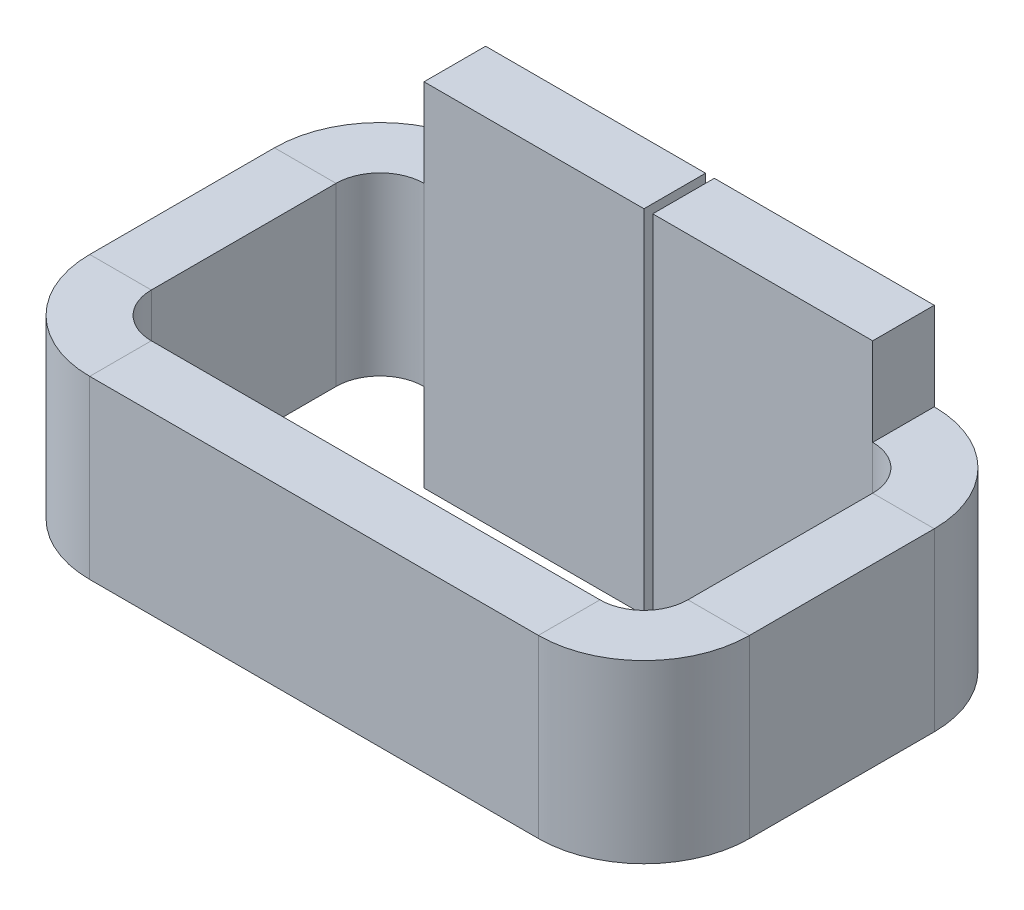
ISO-10303-21;
HEADER;
FILE_DESCRIPTION(('STEP AP214'),'2;1');
FILE_NAME('part.step','',(''),(''),'','','');
FILE_SCHEMA(('AUTOMOTIVE_DESIGN { 1 0 10303 214 1 1 1 1 }'));
ENDSEC;
DATA;
#1=APPLICATION_CONTEXT('core data for automotive mechanical design processes');
#2=APPLICATION_PROTOCOL_DEFINITION('international standard','automotive_design',2000,#1);
#3=PRODUCT_CONTEXT('',#1,'mechanical');
#4=PRODUCT('Part','Part','',(#3));
#5=PRODUCT_RELATED_PRODUCT_CATEGORY('part','',(#4));
#6=PRODUCT_DEFINITION_FORMATION('','',#4);
#7=PRODUCT_DEFINITION_CONTEXT('part definition',#1,'design');
#8=PRODUCT_DEFINITION('design','',#6,#7);
#9=PRODUCT_DEFINITION_SHAPE('','',#8);
#10=(LENGTH_UNIT() NAMED_UNIT(*) SI_UNIT(.MILLI.,.METRE.));
#11=(NAMED_UNIT(*) PLANE_ANGLE_UNIT() SI_UNIT($,.RADIAN.));
#12=(NAMED_UNIT(*) SI_UNIT($,.STERADIAN.) SOLID_ANGLE_UNIT());
#13=UNCERTAINTY_MEASURE_WITH_UNIT(LENGTH_MEASURE(1.E-05),#10,'distance_accuracy_value','');
#14=(GEOMETRIC_REPRESENTATION_CONTEXT(3) GLOBAL_UNCERTAINTY_ASSIGNED_CONTEXT((#13)) GLOBAL_UNIT_ASSIGNED_CONTEXT((#10,
#11,#12)) REPRESENTATION_CONTEXT('',''));
#15=CARTESIAN_POINT('',(0.,0.,0.));
#16=DIRECTION('',(0.,0.,1.));
#17=DIRECTION('',(1.,0.,0.));
#18=AXIS2_PLACEMENT_3D('',#15,#16,#17);
#19=CARTESIAN_POINT('',(3.71873970782007,-0.508000000000001,2.286));
#20=DIRECTION('',(0.,1.,0.));
#21=DIRECTION('',(1.,0.,0.));
#22=AXIS2_PLACEMENT_3D('',#19,#20,#21);
#23=PLANE('',#22);
#24=DIRECTION('',(0.,0.,1.));
#25=VECTOR('',#24,1.);
#26=CARTESIAN_POINT('',(-1.2954,-0.507999999999999,1.9304));
#27=LINE('',#26,#25);
#28=CARTESIAN_POINT('',(-1.2954,-0.507999999999999,1.9304));
#29=VERTEX_POINT('',#28);
#30=CARTESIAN_POINT('',(-1.2954,-0.507999999999999,2.286));
#31=VERTEX_POINT('',#30);
#32=EDGE_CURVE('E10',#29,#31,#27,.T.);
#33=ORIENTED_EDGE('',*,*,#32,.F.);
#34=DIRECTION('',(1.,0.,0.));
#35=VECTOR('',#34,1.);
#36=CARTESIAN_POINT('',(3.71873970782007,-0.508000000000001,1.9304));
#37=LINE('',#36,#35);
#38=CARTESIAN_POINT('',(1.2954,-0.508,1.9304));
#39=VERTEX_POINT('',#38);
#40=EDGE_CURVE('E23',#29,#39,#37,.T.);
#41=ORIENTED_EDGE('',*,*,#40,.T.);
#42=DIRECTION('',(0.,0.,-1.));
#43=VECTOR('',#42,1.);
#44=CARTESIAN_POINT('',(1.2954,-0.508,2.286));
#45=LINE('',#44,#43);
#46=CARTESIAN_POINT('',(1.2954,-0.508,2.286));
#47=VERTEX_POINT('',#46);
#48=EDGE_CURVE('E415',#47,#39,#45,.T.);
#49=ORIENTED_EDGE('',*,*,#48,.F.);
#50=DIRECTION('',(1.,0.,0.));
#51=VECTOR('',#50,1.);
#52=CARTESIAN_POINT('',(3.71873970782007,-0.508000000000001,2.286));
#53=LINE('',#52,#51);
#54=EDGE_CURVE('E412',#31,#47,#53,.T.);
#55=ORIENTED_EDGE('',*,*,#54,.F.);
#56=EDGE_LOOP('',(#33,#41,#49,#55));
#57=FACE_BOUND('',#56,.T.);
#58=ADVANCED_FACE('F16',(#57),#23,.F.);
#59=CARTESIAN_POINT('',(3.71873970782007,0.507999999999999,2.286));
#60=DIRECTION('',(0.,-1.,0.));
#61=DIRECTION('',(-1.,0.,0.));
#62=AXIS2_PLACEMENT_3D('',#59,#60,#61);
#63=PLANE('',#62);
#64=DIRECTION('',(0.,0.,-1.));
#65=VECTOR('',#64,1.);
#66=CARTESIAN_POINT('',(-1.2954,0.508000000000001,2.286));
#67=LINE('',#66,#65);
#68=CARTESIAN_POINT('',(-1.2954,0.508000000000001,2.286));
#69=VERTEX_POINT('',#68);
#70=CARTESIAN_POINT('',(-1.2954,0.508000000000001,1.9304));
#71=VERTEX_POINT('',#70);
#72=EDGE_CURVE('E409',#69,#71,#67,.T.);
#73=ORIENTED_EDGE('',*,*,#72,.F.);
#74=DIRECTION('',(-1.,0.,0.));
#75=VECTOR('',#74,1.);
#76=CARTESIAN_POINT('',(3.71873970782007,0.507999999999999,2.286));
#77=LINE('',#76,#75);
#78=CARTESIAN_POINT('',(1.2954,0.508,2.286));
#79=VERTEX_POINT('',#78);
#80=EDGE_CURVE('E406',#79,#69,#77,.T.);
#81=ORIENTED_EDGE('',*,*,#80,.F.);
#82=DIRECTION('',(0.,0.,1.));
#83=VECTOR('',#82,1.);
#84=CARTESIAN_POINT('',(1.2954,0.508,1.9304));
#85=LINE('',#84,#83);
#86=CARTESIAN_POINT('',(1.2954,0.508,1.9304));
#87=VERTEX_POINT('',#86);
#88=EDGE_CURVE('E403',#87,#79,#85,.T.);
#89=ORIENTED_EDGE('',*,*,#88,.F.);
#90=DIRECTION('',(-1.,0.,0.));
#91=VECTOR('',#90,1.);
#92=CARTESIAN_POINT('',(3.71873970782007,0.507999999999999,1.9304));
#93=LINE('',#92,#91);
#94=EDGE_CURVE('E400',#87,#71,#93,.T.);
#95=ORIENTED_EDGE('',*,*,#94,.T.);
#96=EDGE_LOOP('',(#73,#81,#89,#95));
#97=FACE_BOUND('',#96,.T.);
#98=ADVANCED_FACE('F444',(#97),#63,.F.);
#99=CARTESIAN_POINT('',(1.2954,-1.016,2.286));
#100=DIRECTION('',(0.,0.,1.));
#101=DIRECTION('',(-1.,0.,0.));
#102=AXIS2_PLACEMENT_3D('',#99,#100,#101);
#103=PLANE('',#102);
#104=ORIENTED_EDGE('',*,*,#80,.T.);
#105=DIRECTION('',(0.,1.,0.));
#106=VECTOR('',#105,1.);
#107=CARTESIAN_POINT('',(-1.2954,-1.016,2.286));
#108=LINE('',#107,#106);
#109=EDGE_CURVE('E397',#31,#69,#108,.T.);
#110=ORIENTED_EDGE('',*,*,#109,.F.);
#111=ORIENTED_EDGE('',*,*,#54,.T.);
#112=DIRECTION('',(0.,1.,0.));
#113=VECTOR('',#112,1.);
#114=CARTESIAN_POINT('',(1.2954,-1.016,2.286));
#115=LINE('',#114,#113);
#116=EDGE_CURVE('E394',#47,#79,#115,.T.);
#117=ORIENTED_EDGE('',*,*,#116,.T.);
#118=EDGE_LOOP('',(#104,#110,#111,#117));
#119=FACE_BOUND('',#118,.T.);
#120=ADVANCED_FACE('F437',(#119),#103,.T.);
#121=CARTESIAN_POINT('',(1.2954,-1.016,1.9304));
#122=DIRECTION('',(0.,0.,1.));
#123=DIRECTION('',(-1.,0.,0.));
#124=AXIS2_PLACEMENT_3D('',#121,#122,#123);
#125=PLANE('',#124);
#126=DIRECTION('',(0.,1.,0.));
#127=VECTOR('',#126,1.);
#128=CARTESIAN_POINT('',(-1.2954,-1.016,1.9304));
#129=LINE('',#128,#127);
#130=EDGE_CURVE('E391',#29,#71,#129,.T.);
#131=ORIENTED_EDGE('',*,*,#130,.T.);
#132=ORIENTED_EDGE('',*,*,#94,.F.);
#133=DIRECTION('',(0.,1.,0.));
#134=VECTOR('',#133,1.);
#135=CARTESIAN_POINT('',(1.2954,-1.016,1.9304));
#136=LINE('',#135,#134);
#137=EDGE_CURVE('E388',#39,#87,#136,.T.);
#138=ORIENTED_EDGE('',*,*,#137,.F.);
#139=ORIENTED_EDGE('',*,*,#40,.F.);
#140=EDGE_LOOP('',(#131,#132,#138,#139));
#141=FACE_BOUND('',#140,.T.);
#142=ADVANCED_FACE('F421',(#141),#125,.F.);
#143=CARTESIAN_POINT('',(0.0254,-1.016,0.));
#144=DIRECTION('',(-1.,0.,0.));
#145=DIRECTION('',(0.,0.,-1.));
#146=AXIS2_PLACEMENT_3D('',#143,#144,#145);
#147=PLANE('',#146);
#148=DIRECTION('',(0.,0.,1.));
#149=VECTOR('',#148,1.);
#150=CARTESIAN_POINT('',(0.0254000000000005,1.016,0.));
#151=LINE('',#150,#149);
#152=CARTESIAN_POINT('',(0.0254000000000005,1.016,0.));
#153=VERTEX_POINT('',#152);
#154=CARTESIAN_POINT('',(0.0254000000000005,1.016,0.3556));
#155=VERTEX_POINT('',#154);
#156=EDGE_CURVE('E386',#153,#155,#151,.T.);
#157=ORIENTED_EDGE('',*,*,#156,.F.);
#158=DIRECTION('',(0.,1.,0.));
#159=VECTOR('',#158,1.);
#160=CARTESIAN_POINT('',(0.0254,-1.016,0.));
#161=LINE('',#160,#159);
#162=CARTESIAN_POINT('',(0.0254,-1.016,0.));
#163=VERTEX_POINT('',#162);
#164=EDGE_CURVE('E383',#163,#153,#161,.T.);
#165=ORIENTED_EDGE('',*,*,#164,.F.);
#166=DIRECTION('',(0.,0.,1.));
#167=VECTOR('',#166,1.);
#168=CARTESIAN_POINT('',(0.0254,-1.016,0.));
#169=LINE('',#168,#167);
#170=CARTESIAN_POINT('',(0.0254,-1.016,0.3556));
#171=VERTEX_POINT('',#170);
#172=EDGE_CURVE('E381',#163,#171,#169,.T.);
#173=ORIENTED_EDGE('',*,*,#172,.T.);
#174=DIRECTION('',(0.,1.,0.));
#175=VECTOR('',#174,1.);
#176=CARTESIAN_POINT('',(0.0254,-1.016,0.3556));
#177=LINE('',#176,#175);
#178=EDGE_CURVE('E378',#171,#155,#177,.T.);
#179=ORIENTED_EDGE('',*,*,#178,.T.);
#180=EDGE_LOOP('',(#157,#165,#173,#179));
#181=FACE_BOUND('',#180,.T.);
#182=ADVANCED_FACE('F507',(#181),#147,.T.);
#183=CARTESIAN_POINT('',(1.5494,-1.016,0.6096));
#184=DIRECTION('',(0.,-1.,0.));
#185=DIRECTION('',(1.,0.,0.));
#186=AXIS2_PLACEMENT_3D('',#183,#184,#185);
#187=PLANE('',#186);
#188=DIRECTION('',(-1.,0.,0.));
#189=VECTOR('',#188,1.);
#190=CARTESIAN_POINT('',(0.0254,-1.016,0.));
#191=LINE('',#190,#189);
#192=CARTESIAN_POINT('',(1.2954,-1.016,0.));
#193=VERTEX_POINT('',#192);
#194=EDGE_CURVE('E375',#193,#163,#191,.T.);
#195=ORIENTED_EDGE('',*,*,#194,.F.);
#196=DIRECTION('',(0.,0.,1.));
#197=VECTOR('',#196,1.);
#198=CARTESIAN_POINT('',(1.2954,-1.016,0.));
#199=LINE('',#198,#197);
#200=CARTESIAN_POINT('',(1.2954,-1.016,0.3556));
#201=VERTEX_POINT('',#200);
#202=EDGE_CURVE('E372',#193,#201,#199,.T.);
#203=ORIENTED_EDGE('',*,*,#202,.T.);
#204=DIRECTION('',(-1.,0.,0.));
#205=VECTOR('',#204,1.);
#206=CARTESIAN_POINT('',(0.0254,-1.016,0.3556));
#207=LINE('',#206,#205);
#208=EDGE_CURVE('E369',#201,#171,#207,.T.);
#209=ORIENTED_EDGE('',*,*,#208,.T.);
#210=ORIENTED_EDGE('',*,*,#172,.F.);
#211=EDGE_LOOP('',(#195,#203,#209,#210));
#212=FACE_BOUND('',#211,.T.);
#213=ADVANCED_FACE('F510',(#212),#187,.T.);
#214=CARTESIAN_POINT('',(1.2954,1.016,0.6096));
#215=DIRECTION('',(0.,1.,0.));
#216=DIRECTION('',(-1.,0.,0.));
#217=AXIS2_PLACEMENT_3D('',#214,#215,#216);
#218=PLANE('',#217);
#219=DIRECTION('',(-1.,0.,0.));
#220=VECTOR('',#219,1.);
#221=CARTESIAN_POINT('',(0.0254000000000005,1.016,0.3556));
#222=LINE('',#221,#220);
#223=CARTESIAN_POINT('',(1.2954,1.016,0.3556));
#224=VERTEX_POINT('',#223);
#225=EDGE_CURVE('E366',#224,#155,#222,.T.);
#226=ORIENTED_EDGE('',*,*,#225,.F.);
#227=DIRECTION('',(0.,0.,-1.));
#228=VECTOR('',#227,1.);
#229=CARTESIAN_POINT('',(1.2954,1.016,0.3556));
#230=LINE('',#229,#228);
#231=CARTESIAN_POINT('',(1.2954,1.016,0.));
#232=VERTEX_POINT('',#231);
#233=EDGE_CURVE('E363',#224,#232,#230,.T.);
#234=ORIENTED_EDGE('',*,*,#233,.T.);
#235=DIRECTION('',(-1.,0.,0.));
#236=VECTOR('',#235,1.);
#237=CARTESIAN_POINT('',(0.0254000000000005,1.016,0.));
#238=LINE('',#237,#236);
#239=EDGE_CURVE('E360',#232,#153,#238,.T.);
#240=ORIENTED_EDGE('',*,*,#239,.T.);
#241=ORIENTED_EDGE('',*,*,#156,.T.);
#242=EDGE_LOOP('',(#226,#234,#240,#241));
#243=FACE_BOUND('',#242,.T.);
#244=ADVANCED_FACE('F514',(#243),#218,.T.);
#245=CARTESIAN_POINT('',(1.2954,1.016,0.));
#246=DIRECTION('',(-1.,0.,0.));
#247=DIRECTION('',(0.,-1.,0.));
#248=AXIS2_PLACEMENT_3D('',#245,#246,#247);
#249=PLANE('',#248);
#250=DIRECTION('',(0.,-1.,0.));
#251=VECTOR('',#250,1.);
#252=CARTESIAN_POINT('',(1.2954,1.016,0.3556));
#253=LINE('',#252,#251);
#254=CARTESIAN_POINT('',(1.2954,0.508,0.3556));
#255=VERTEX_POINT('',#254);
#256=EDGE_CURVE('E358',#224,#255,#253,.T.);
#257=ORIENTED_EDGE('',*,*,#256,.T.);
#258=DIRECTION('',(0.,0.,1.));
#259=VECTOR('',#258,1.);
#260=CARTESIAN_POINT('',(1.2954,0.508,0.));
#261=LINE('',#260,#259);
#262=CARTESIAN_POINT('',(1.2954,0.508,0.));
#263=VERTEX_POINT('',#262);
#264=EDGE_CURVE('E355',#263,#255,#261,.T.);
#265=ORIENTED_EDGE('',*,*,#264,.F.);
#266=DIRECTION('',(0.,-1.,0.));
#267=VECTOR('',#266,1.);
#268=CARTESIAN_POINT('',(1.2954,1.016,0.));
#269=LINE('',#268,#267);
#270=EDGE_CURVE('E352',#232,#263,#269,.T.);
#271=ORIENTED_EDGE('',*,*,#270,.F.);
#272=ORIENTED_EDGE('',*,*,#233,.F.);
#273=EDGE_LOOP('',(#257,#265,#271,#272));
#274=FACE_BOUND('',#273,.T.);
#275=ADVANCED_FACE('F518',(#274),#249,.F.);
#276=CARTESIAN_POINT('',(0.0254,-1.016,0.3556));
#277=DIRECTION('',(0.,0.,-1.));
#278=DIRECTION('',(1.,0.,0.));
#279=AXIS2_PLACEMENT_3D('',#276,#277,#278);
#280=PLANE('',#279);
#281=ORIENTED_EDGE('',*,*,#225,.T.);
#282=ORIENTED_EDGE('',*,*,#178,.F.);
#283=ORIENTED_EDGE('',*,*,#208,.F.);
#284=DIRECTION('',(0.,1.,0.));
#285=VECTOR('',#284,1.);
#286=CARTESIAN_POINT('',(1.2954,-1.016,0.3556));
#287=LINE('',#286,#285);
#288=CARTESIAN_POINT('',(1.2954,-0.508,0.3556));
#289=VERTEX_POINT('',#288);
#290=EDGE_CURVE('E350',#201,#289,#287,.T.);
#291=ORIENTED_EDGE('',*,*,#290,.T.);
#292=DIRECTION('',(0.,1.,0.));
#293=VECTOR('',#292,1.);
#294=CARTESIAN_POINT('',(1.2954,-1.016,0.3556));
#295=LINE('',#294,#293);
#296=EDGE_CURVE('E347',#289,#255,#295,.T.);
#297=ORIENTED_EDGE('',*,*,#296,.T.);
#298=ORIENTED_EDGE('',*,*,#256,.F.);
#299=EDGE_LOOP('',(#281,#282,#283,#291,#297,#298));
#300=FACE_BOUND('',#299,.T.);
#301=ADVANCED_FACE('F522',(#300),#280,.F.);
#302=CARTESIAN_POINT('',(1.2954,-1.016,0.));
#303=DIRECTION('',(-1.,0.,0.));
#304=DIRECTION('',(0.,-1.,0.));
#305=AXIS2_PLACEMENT_3D('',#302,#303,#304);
#306=PLANE('',#305);
#307=ORIENTED_EDGE('',*,*,#290,.F.);
#308=ORIENTED_EDGE('',*,*,#202,.F.);
#309=DIRECTION('',(0.,1.,0.));
#310=VECTOR('',#309,1.);
#311=CARTESIAN_POINT('',(1.2954,-1.016,0.));
#312=LINE('',#311,#310);
#313=CARTESIAN_POINT('',(1.2954,-0.508,0.));
#314=VERTEX_POINT('',#313);
#315=EDGE_CURVE('E345',#193,#314,#312,.T.);
#316=ORIENTED_EDGE('',*,*,#315,.T.);
#317=DIRECTION('',(0.,0.,1.));
#318=VECTOR('',#317,1.);
#319=CARTESIAN_POINT('',(1.2954,-0.508,0.));
#320=LINE('',#319,#318);
#321=EDGE_CURVE('E342',#314,#289,#320,.T.);
#322=ORIENTED_EDGE('',*,*,#321,.T.);
#323=EDGE_LOOP('',(#307,#308,#316,#322));
#324=FACE_BOUND('',#323,.T.);
#325=ADVANCED_FACE('F526',(#324),#306,.F.);
#326=CARTESIAN_POINT('',(0.0254,-1.016,0.));
#327=DIRECTION('',(0.,0.,-1.));
#328=DIRECTION('',(1.,0.,0.));
#329=AXIS2_PLACEMENT_3D('',#326,#327,#328);
#330=PLANE('',#329);
#331=ORIENTED_EDGE('',*,*,#239,.F.);
#332=ORIENTED_EDGE('',*,*,#270,.T.);
#333=DIRECTION('',(0.,1.,0.));
#334=VECTOR('',#333,1.);
#335=CARTESIAN_POINT('',(1.2954,-1.016,0.));
#336=LINE('',#335,#334);
#337=EDGE_CURVE('E339',#314,#263,#336,.T.);
#338=ORIENTED_EDGE('',*,*,#337,.F.);
#339=ORIENTED_EDGE('',*,*,#315,.F.);
#340=ORIENTED_EDGE('',*,*,#194,.T.);
#341=ORIENTED_EDGE('',*,*,#164,.T.);
#342=EDGE_LOOP('',(#331,#332,#338,#339,#340,#341));
#343=FACE_BOUND('',#342,.T.);
#344=ADVANCED_FACE('F530',(#343),#330,.T.);
#345=CARTESIAN_POINT('',(1.2954,0.508,0.6096));
#346=DIRECTION('',(0.,1.,0.));
#347=DIRECTION('',(-1.,0.,0.));
#348=AXIS2_PLACEMENT_3D('',#345,#346,#347);
#349=PLANE('',#348);
#350=ORIENTED_EDGE('',*,*,#264,.T.);
#351=CARTESIAN_POINT('',(1.2954,0.508,0.6096));
#352=DIRECTION('',(0.,-1.,0.));
#353=DIRECTION('',(1.,0.,0.));
#354=AXIS2_PLACEMENT_3D('',#351,#352,#353);
#355=CIRCLE('',#354,0.254);
#356=CARTESIAN_POINT('',(1.5494,0.508,0.609599999999999));
#357=VERTEX_POINT('',#356);
#358=EDGE_CURVE('E336',#255,#357,#355,.T.);
#359=ORIENTED_EDGE('',*,*,#358,.T.);
#360=DIRECTION('',(1.,0.,0.));
#361=VECTOR('',#360,1.);
#362=CARTESIAN_POINT('',(1.5494,0.508,0.609599999999999));
#363=LINE('',#362,#361);
#364=CARTESIAN_POINT('',(1.905,0.508,0.6096));
#365=VERTEX_POINT('',#364);
#366=EDGE_CURVE('E334',#357,#365,#363,.T.);
#367=ORIENTED_EDGE('',*,*,#366,.T.);
#368=CARTESIAN_POINT('',(1.2954,0.508,0.6096));
#369=DIRECTION('',(0.,-1.,0.));
#370=DIRECTION('',(1.,0.,0.));
#371=AXIS2_PLACEMENT_3D('',#368,#369,#370);
#372=CIRCLE('',#371,0.6096);
#373=EDGE_CURVE('E331',#263,#365,#372,.T.);
#374=ORIENTED_EDGE('',*,*,#373,.F.);
#375=EDGE_LOOP('',(#350,#359,#367,#374));
#376=FACE_BOUND('',#375,.T.);
#377=ADVANCED_FACE('F534',(#376),#349,.T.);
#378=CARTESIAN_POINT('',(1.2954,1.27230395532009,0.6096));
#379=DIRECTION('',(0.,-1.,0.));
#380=DIRECTION('',(1.,0.,0.));
#381=AXIS2_PLACEMENT_3D('',#378,#379,#380);
#382=CYLINDRICAL_SURFACE('',#381,0.254);
#383=CARTESIAN_POINT('',(1.2954,-0.508,0.6096));
#384=DIRECTION('',(0.,1.,0.));
#385=DIRECTION('',(1.,0.,0.));
#386=AXIS2_PLACEMENT_3D('',#383,#384,#385);
#387=CIRCLE('',#386,0.254);
#388=CARTESIAN_POINT('',(1.5494,-0.508,0.609599999999999));
#389=VERTEX_POINT('',#388);
#390=EDGE_CURVE('E328',#389,#289,#387,.T.);
#391=ORIENTED_EDGE('',*,*,#390,.F.);
#392=DIRECTION('',(0.,1.,0.));
#393=VECTOR('',#392,1.);
#394=CARTESIAN_POINT('',(1.5494,-1.016,0.6096));
#395=LINE('',#394,#393);
#396=EDGE_CURVE('E325',#389,#357,#395,.T.);
#397=ORIENTED_EDGE('',*,*,#396,.T.);
#398=ORIENTED_EDGE('',*,*,#358,.F.);
#399=ORIENTED_EDGE('',*,*,#296,.F.);
#400=EDGE_LOOP('',(#391,#397,#398,#399));
#401=FACE_BOUND('',#400,.T.);
#402=ADVANCED_FACE('F538',(#401),#382,.F.);
#403=CARTESIAN_POINT('',(1.2954,-0.508,0.6096));
#404=DIRECTION('',(0.,-1.,0.));
#405=DIRECTION('',(1.,0.,0.));
#406=AXIS2_PLACEMENT_3D('',#403,#404,#405);
#407=PLANE('',#406);
#408=DIRECTION('',(-1.,0.,0.));
#409=VECTOR('',#408,1.);
#410=CARTESIAN_POINT('',(1.905,-0.508000000000001,0.6096));
#411=LINE('',#410,#409);
#412=CARTESIAN_POINT('',(1.905,-0.508,0.609599999999997));
#413=VERTEX_POINT('',#412);
#414=EDGE_CURVE('E322',#413,#389,#411,.T.);
#415=ORIENTED_EDGE('',*,*,#414,.T.);
#416=ORIENTED_EDGE('',*,*,#390,.T.);
#417=ORIENTED_EDGE('',*,*,#321,.F.);
#418=CARTESIAN_POINT('',(1.2954,-0.508,0.6096));
#419=DIRECTION('',(0.,1.,0.));
#420=DIRECTION('',(-1.,0.,0.));
#421=AXIS2_PLACEMENT_3D('',#418,#419,#420);
#422=CIRCLE('',#421,0.6096);
#423=EDGE_CURVE('E319',#413,#314,#422,.T.);
#424=ORIENTED_EDGE('',*,*,#423,.F.);
#425=EDGE_LOOP('',(#415,#416,#417,#424));
#426=FACE_BOUND('',#425,.T.);
#427=ADVANCED_FACE('F542',(#426),#407,.T.);
#428=CARTESIAN_POINT('',(1.2954,1.27230395532009,0.6096));
#429=DIRECTION('',(0.,-1.,0.));
#430=DIRECTION('',(1.,0.,0.));
#431=AXIS2_PLACEMENT_3D('',#428,#429,#430);
#432=CYLINDRICAL_SURFACE('',#431,0.6096);
#433=ORIENTED_EDGE('',*,*,#423,.T.);
#434=ORIENTED_EDGE('',*,*,#337,.T.);
#435=ORIENTED_EDGE('',*,*,#373,.T.);
#436=DIRECTION('',(0.,1.,0.));
#437=VECTOR('',#436,1.);
#438=CARTESIAN_POINT('',(1.905,-1.016,0.6096));
#439=LINE('',#438,#437);
#440=EDGE_CURVE('E316',#413,#365,#439,.T.);
#441=ORIENTED_EDGE('',*,*,#440,.F.);
#442=EDGE_LOOP('',(#433,#434,#435,#441));
#443=FACE_BOUND('',#442,.T.);
#444=ADVANCED_FACE('F546',(#443),#432,.T.);
#445=CARTESIAN_POINT('',(1.905,-1.016,0.6096));
#446=DIRECTION('',(1.,0.,0.));
#447=DIRECTION('',(0.,0.,1.));
#448=AXIS2_PLACEMENT_3D('',#445,#446,#447);
#449=PLANE('',#448);
#450=DIRECTION('',(0.,0.,1.));
#451=VECTOR('',#450,1.);
#452=CARTESIAN_POINT('',(1.905,0.508,-0.0686698539100349));
#453=LINE('',#452,#451);
#454=CARTESIAN_POINT('',(1.905,0.508,1.6764));
#455=VERTEX_POINT('',#454);
#456=EDGE_CURVE('E313',#365,#455,#453,.T.);
#457=ORIENTED_EDGE('',*,*,#456,.T.);
#458=DIRECTION('',(0.,1.,0.));
#459=VECTOR('',#458,1.);
#460=CARTESIAN_POINT('',(1.905,-1.016,1.6764));
#461=LINE('',#460,#459);
#462=CARTESIAN_POINT('',(1.905,-0.508,1.6764));
#463=VERTEX_POINT('',#462);
#464=EDGE_CURVE('E310',#463,#455,#461,.T.);
#465=ORIENTED_EDGE('',*,*,#464,.F.);
#466=DIRECTION('',(0.,0.,-1.));
#467=VECTOR('',#466,1.);
#468=CARTESIAN_POINT('',(1.905,-0.508000000000001,-0.0686698539100348));
#469=LINE('',#468,#467);
#470=EDGE_CURVE('E307',#463,#413,#469,.T.);
#471=ORIENTED_EDGE('',*,*,#470,.T.);
#472=ORIENTED_EDGE('',*,*,#440,.T.);
#473=EDGE_LOOP('',(#457,#465,#471,#472));
#474=FACE_BOUND('',#473,.T.);
#475=ADVANCED_FACE('F550',(#474),#449,.T.);
#476=CARTESIAN_POINT('',(1.905,-0.508000000000001,-0.0686698539100348));
#477=DIRECTION('',(0.,1.,0.));
#478=DIRECTION('',(0.,0.,-1.));
#479=AXIS2_PLACEMENT_3D('',#476,#477,#478);
#480=PLANE('',#479);
#481=DIRECTION('',(1.,0.,0.));
#482=VECTOR('',#481,1.);
#483=CARTESIAN_POINT('',(1.5494,-0.508,1.6764));
#484=LINE('',#483,#482);
#485=CARTESIAN_POINT('',(1.5494,-0.508,1.6764));
#486=VERTEX_POINT('',#485);
#487=EDGE_CURVE('E304',#486,#463,#484,.T.);
#488=ORIENTED_EDGE('',*,*,#487,.F.);
#489=DIRECTION('',(0.,0.,-1.));
#490=VECTOR('',#489,1.);
#491=CARTESIAN_POINT('',(1.5494,-0.508,-0.0686698539100348));
#492=LINE('',#491,#490);
#493=EDGE_CURVE('E301',#486,#389,#492,.T.);
#494=ORIENTED_EDGE('',*,*,#493,.T.);
#495=ORIENTED_EDGE('',*,*,#414,.F.);
#496=ORIENTED_EDGE('',*,*,#470,.F.);
#497=EDGE_LOOP('',(#488,#494,#495,#496));
#498=FACE_BOUND('',#497,.T.);
#499=ADVANCED_FACE('F554',(#498),#480,.F.);
#500=CARTESIAN_POINT('',(1.5494,-1.016,0.6096));
#501=DIRECTION('',(1.,0.,0.));
#502=DIRECTION('',(0.,0.,1.));
#503=AXIS2_PLACEMENT_3D('',#500,#501,#502);
#504=PLANE('',#503);
#505=DIRECTION('',(0.,1.,0.));
#506=VECTOR('',#505,1.);
#507=CARTESIAN_POINT('',(1.5494,-1.016,1.6764));
#508=LINE('',#507,#506);
#509=CARTESIAN_POINT('',(1.5494,0.508,1.6764));
#510=VERTEX_POINT('',#509);
#511=EDGE_CURVE('E298',#486,#510,#508,.T.);
#512=ORIENTED_EDGE('',*,*,#511,.T.);
#513=DIRECTION('',(0.,0.,1.));
#514=VECTOR('',#513,1.);
#515=CARTESIAN_POINT('',(1.5494,0.508,-0.0686698539100349));
#516=LINE('',#515,#514);
#517=EDGE_CURVE('E296',#357,#510,#516,.T.);
#518=ORIENTED_EDGE('',*,*,#517,.F.);
#519=ORIENTED_EDGE('',*,*,#396,.F.);
#520=ORIENTED_EDGE('',*,*,#493,.F.);
#521=EDGE_LOOP('',(#512,#518,#519,#520));
#522=FACE_BOUND('',#521,.T.);
#523=ADVANCED_FACE('F558',(#522),#504,.F.);
#524=CARTESIAN_POINT('',(1.905,0.508,-0.0686698539100349));
#525=DIRECTION('',(0.,-1.,0.));
#526=DIRECTION('',(0.,0.,1.));
#527=AXIS2_PLACEMENT_3D('',#524,#525,#526);
#528=PLANE('',#527);
#529=DIRECTION('',(-1.,0.,0.));
#530=VECTOR('',#529,1.);
#531=CARTESIAN_POINT('',(1.905,0.508,1.6764));
#532=LINE('',#531,#530);
#533=EDGE_CURVE('E293',#455,#510,#532,.T.);
#534=ORIENTED_EDGE('',*,*,#533,.F.);
#535=ORIENTED_EDGE('',*,*,#456,.F.);
#536=ORIENTED_EDGE('',*,*,#366,.F.);
#537=ORIENTED_EDGE('',*,*,#517,.T.);
#538=EDGE_LOOP('',(#534,#535,#536,#537));
#539=FACE_BOUND('',#538,.T.);
#540=ADVANCED_FACE('F562',(#539),#528,.F.);
#541=CARTESIAN_POINT('',(1.2954,0.508,1.6764));
#542=DIRECTION('',(0.,1.,0.));
#543=DIRECTION('',(-1.,0.,0.));
#544=AXIS2_PLACEMENT_3D('',#541,#542,#543);
#545=PLANE('',#544);
#546=ORIENTED_EDGE('',*,*,#533,.T.);
#547=CARTESIAN_POINT('',(1.2954,0.508,1.6764));
#548=DIRECTION('',(0.,-1.,0.));
#549=DIRECTION('',(1.,0.,0.));
#550=AXIS2_PLACEMENT_3D('',#547,#548,#549);
#551=CIRCLE('',#550,0.254);
#552=EDGE_CURVE('E291',#510,#87,#551,.T.);
#553=ORIENTED_EDGE('',*,*,#552,.T.);
#554=ORIENTED_EDGE('',*,*,#88,.T.);
#555=CARTESIAN_POINT('',(1.2954,0.508,1.6764));
#556=DIRECTION('',(0.,-1.,0.));
#557=DIRECTION('',(1.,0.,0.));
#558=AXIS2_PLACEMENT_3D('',#555,#556,#557);
#559=CIRCLE('',#558,0.6096);
#560=EDGE_CURVE('E289',#455,#79,#559,.T.);
#561=ORIENTED_EDGE('',*,*,#560,.F.);
#562=EDGE_LOOP('',(#546,#553,#554,#561));
#563=FACE_BOUND('',#562,.T.);
#564=ADVANCED_FACE('F566',(#563),#545,.T.);
#565=CARTESIAN_POINT('',(1.2954,-0.508,1.6764));
#566=DIRECTION('',(0.,-1.,0.));
#567=DIRECTION('',(1.,0.,0.));
#568=AXIS2_PLACEMENT_3D('',#565,#566,#567);
#569=PLANE('',#568);
#570=ORIENTED_EDGE('',*,*,#48,.T.);
#571=CARTESIAN_POINT('',(1.2954,-0.508,1.6764));
#572=DIRECTION('',(0.,1.,0.));
#573=DIRECTION('',(1.,0.,0.));
#574=AXIS2_PLACEMENT_3D('',#571,#572,#573);
#575=CIRCLE('',#574,0.254);
#576=EDGE_CURVE('E287',#39,#486,#575,.T.);
#577=ORIENTED_EDGE('',*,*,#576,.T.);
#578=ORIENTED_EDGE('',*,*,#487,.T.);
#579=CARTESIAN_POINT('',(1.2954,-0.508,1.6764));
#580=DIRECTION('',(0.,1.,0.));
#581=DIRECTION('',(-1.,0.,0.));
#582=AXIS2_PLACEMENT_3D('',#579,#580,#581);
#583=CIRCLE('',#582,0.6096);
#584=EDGE_CURVE('E285',#47,#463,#583,.T.);
#585=ORIENTED_EDGE('',*,*,#584,.F.);
#586=EDGE_LOOP('',(#570,#577,#578,#585));
#587=FACE_BOUND('',#586,.T.);
#588=ADVANCED_FACE('F428',(#587),#569,.T.);
#589=CARTESIAN_POINT('',(1.2954,1.27230395532009,1.6764));
#590=DIRECTION('',(0.,-1.,0.));
#591=DIRECTION('',(1.,0.,0.));
#592=AXIS2_PLACEMENT_3D('',#589,#590,#591);
#593=CYLINDRICAL_SURFACE('',#592,0.6096);
#594=ORIENTED_EDGE('',*,*,#584,.T.);
#595=ORIENTED_EDGE('',*,*,#464,.T.);
#596=ORIENTED_EDGE('',*,*,#560,.T.);
#597=ORIENTED_EDGE('',*,*,#116,.F.);
#598=EDGE_LOOP('',(#594,#595,#596,#597));
#599=FACE_BOUND('',#598,.T.);
#600=ADVANCED_FACE('F433',(#599),#593,.T.);
#601=CARTESIAN_POINT('',(1.2954,1.27230395532009,1.6764));
#602=DIRECTION('',(0.,-1.,0.));
#603=DIRECTION('',(1.,0.,0.));
#604=AXIS2_PLACEMENT_3D('',#601,#602,#603);
#605=CYLINDRICAL_SURFACE('',#604,0.254);
#606=ORIENTED_EDGE('',*,*,#576,.F.);
#607=ORIENTED_EDGE('',*,*,#137,.T.);
#608=ORIENTED_EDGE('',*,*,#552,.F.);
#609=ORIENTED_EDGE('',*,*,#511,.F.);
#610=EDGE_LOOP('',(#606,#607,#608,#609));
#611=FACE_BOUND('',#610,.T.);
#612=ADVANCED_FACE('F575',(#611),#605,.F.);
#613=CARTESIAN_POINT('',(-1.2954,0.508000000000002,1.6764));
#614=DIRECTION('',(0.,1.,0.));
#615=DIRECTION('',(-1.,0.,0.));
#616=AXIS2_PLACEMENT_3D('',#613,#614,#615);
#617=PLANE('',#616);
#618=ORIENTED_EDGE('',*,*,#72,.T.);
#619=CARTESIAN_POINT('',(-1.2954,0.508000000000002,1.6764));
#620=DIRECTION('',(0.,-1.,0.));
#621=DIRECTION('',(1.,0.,0.));
#622=AXIS2_PLACEMENT_3D('',#619,#620,#621);
#623=CIRCLE('',#622,0.254);
#624=CARTESIAN_POINT('',(-1.5494,0.508000000000001,1.6764));
#625=VERTEX_POINT('',#624);
#626=EDGE_CURVE('E283',#71,#625,#623,.T.);
#627=ORIENTED_EDGE('',*,*,#626,.T.);
#628=DIRECTION('',(-1.,0.,0.));
#629=VECTOR('',#628,1.);
#630=CARTESIAN_POINT('',(-1.5494,0.508000000000001,1.6764));
#631=LINE('',#630,#629);
#632=CARTESIAN_POINT('',(-1.905,0.508000000000001,1.6764));
#633=VERTEX_POINT('',#632);
#634=EDGE_CURVE('E281',#625,#633,#631,.T.);
#635=ORIENTED_EDGE('',*,*,#634,.T.);
#636=CARTESIAN_POINT('',(-1.2954,0.508000000000002,1.6764));
#637=DIRECTION('',(0.,-1.,0.));
#638=DIRECTION('',(1.,0.,0.));
#639=AXIS2_PLACEMENT_3D('',#636,#637,#638);
#640=CIRCLE('',#639,0.6096);
#641=EDGE_CURVE('E278',#69,#633,#640,.T.);
#642=ORIENTED_EDGE('',*,*,#641,.F.);
#643=EDGE_LOOP('',(#618,#627,#635,#642));
#644=FACE_BOUND('',#643,.T.);
#645=ADVANCED_FACE('F446',(#644),#617,.T.);
#646=CARTESIAN_POINT('',(-1.2954,-0.507999999999999,1.6764));
#647=DIRECTION('',(0.,-1.,0.));
#648=DIRECTION('',(1.,0.,0.));
#649=AXIS2_PLACEMENT_3D('',#646,#647,#648);
#650=PLANE('',#649);
#651=DIRECTION('',(1.,0.,0.));
#652=VECTOR('',#651,1.);
#653=CARTESIAN_POINT('',(-1.905,-0.507999999999999,1.6764));
#654=LINE('',#653,#652);
#655=CARTESIAN_POINT('',(-1.905,-0.507999999999999,1.6764));
#656=VERTEX_POINT('',#655);
#657=CARTESIAN_POINT('',(-1.5494,-0.507999999999999,1.6764));
#658=VERTEX_POINT('',#657);
#659=EDGE_CURVE('E276',#656,#658,#654,.T.);
#660=ORIENTED_EDGE('',*,*,#659,.T.);
#661=CARTESIAN_POINT('',(-1.2954,-0.507999999999998,1.6764));
#662=DIRECTION('',(0.,1.,0.));
#663=DIRECTION('',(1.,0.,0.));
#664=AXIS2_PLACEMENT_3D('',#661,#662,#663);
#665=CIRCLE('',#664,0.254);
#666=EDGE_CURVE('E274',#658,#29,#665,.T.);
#667=ORIENTED_EDGE('',*,*,#666,.T.);
#668=ORIENTED_EDGE('',*,*,#32,.T.);
#669=CARTESIAN_POINT('',(-1.2954,-0.507999999999999,1.6764));
#670=DIRECTION('',(0.,1.,0.));
#671=DIRECTION('',(-1.,0.,0.));
#672=AXIS2_PLACEMENT_3D('',#669,#670,#671);
#673=CIRCLE('',#672,0.6096);
#674=EDGE_CURVE('E272',#656,#31,#673,.T.);
#675=ORIENTED_EDGE('',*,*,#674,.F.);
#676=EDGE_LOOP('',(#660,#667,#668,#675));
#677=FACE_BOUND('',#676,.T.);
#678=ADVANCED_FACE('F580',(#677),#650,.T.);
#679=CARTESIAN_POINT('',(-1.2954,1.27230395532009,1.6764));
#680=DIRECTION('',(0.,-1.,0.));
#681=DIRECTION('',(1.,0.,0.));
#682=AXIS2_PLACEMENT_3D('',#679,#680,#681);
#683=CYLINDRICAL_SURFACE('',#682,0.6096);
#684=ORIENTED_EDGE('',*,*,#674,.T.);
#685=ORIENTED_EDGE('',*,*,#109,.T.);
#686=ORIENTED_EDGE('',*,*,#641,.T.);
#687=DIRECTION('',(0.,1.,0.));
#688=VECTOR('',#687,1.);
#689=CARTESIAN_POINT('',(-1.905,-1.016,1.6764));
#690=LINE('',#689,#688);
#691=EDGE_CURVE('E269',#656,#633,#690,.T.);
#692=ORIENTED_EDGE('',*,*,#691,.F.);
#693=EDGE_LOOP('',(#684,#685,#686,#692));
#694=FACE_BOUND('',#693,.T.);
#695=ADVANCED_FACE('F441',(#694),#683,.T.);
#696=CARTESIAN_POINT('',(-1.2954,1.27230395532009,1.6764));
#697=DIRECTION('',(0.,-1.,0.));
#698=DIRECTION('',(1.,0.,0.));
#699=AXIS2_PLACEMENT_3D('',#696,#697,#698);
#700=CYLINDRICAL_SURFACE('',#699,0.254);
#701=ORIENTED_EDGE('',*,*,#666,.F.);
#702=DIRECTION('',(0.,1.,0.));
#703=VECTOR('',#702,1.);
#704=CARTESIAN_POINT('',(-1.5494,-1.016,1.6764));
#705=LINE('',#704,#703);
#706=EDGE_CURVE('E266',#658,#625,#705,.T.);
#707=ORIENTED_EDGE('',*,*,#706,.T.);
#708=ORIENTED_EDGE('',*,*,#626,.F.);
#709=ORIENTED_EDGE('',*,*,#130,.F.);
#710=EDGE_LOOP('',(#701,#707,#708,#709));
#711=FACE_BOUND('',#710,.T.);
#712=ADVANCED_FACE('F456',(#711),#700,.F.);
#713=CARTESIAN_POINT('',(-1.905,-1.016,0.609600000000001));
#714=DIRECTION('',(-1.,0.,0.));
#715=DIRECTION('',(0.,-1.,0.));
#716=AXIS2_PLACEMENT_3D('',#713,#714,#715);
#717=PLANE('',#716);
#718=DIRECTION('',(0.,0.,-1.));
#719=VECTOR('',#718,1.);
#720=CARTESIAN_POINT('',(-1.905,0.508000000000001,7.36880956173011));
#721=LINE('',#720,#719);
#722=CARTESIAN_POINT('',(-1.905,0.508000000000002,0.609600000000001));
#723=VERTEX_POINT('',#722);
#724=EDGE_CURVE('E264',#633,#723,#721,.T.);
#725=ORIENTED_EDGE('',*,*,#724,.T.);
#726=DIRECTION('',(0.,1.,0.));
#727=VECTOR('',#726,1.);
#728=CARTESIAN_POINT('',(-1.905,-1.016,0.609600000000001));
#729=LINE('',#728,#727);
#730=CARTESIAN_POINT('',(-1.905,-0.507999999999999,0.609600000000001));
#731=VERTEX_POINT('',#730);
#732=EDGE_CURVE('E261',#731,#723,#729,.T.);
#733=ORIENTED_EDGE('',*,*,#732,.F.);
#734=DIRECTION('',(0.,0.,1.));
#735=VECTOR('',#734,1.);
#736=CARTESIAN_POINT('',(-1.905,-0.507999999999999,7.36880956173011));
#737=LINE('',#736,#735);
#738=EDGE_CURVE('E258',#731,#656,#737,.T.);
#739=ORIENTED_EDGE('',*,*,#738,.T.);
#740=ORIENTED_EDGE('',*,*,#691,.T.);
#741=EDGE_LOOP('',(#725,#733,#739,#740));
#742=FACE_BOUND('',#741,.T.);
#743=ADVANCED_FACE('F587',(#742),#717,.T.);
#744=CARTESIAN_POINT('',(-1.905,0.508000000000001,7.36880956173011));
#745=DIRECTION('',(0.,-1.,0.));
#746=DIRECTION('',(0.,0.,-1.));
#747=AXIS2_PLACEMENT_3D('',#744,#745,#746);
#748=PLANE('',#747);
#749=DIRECTION('',(1.,0.,0.));
#750=VECTOR('',#749,1.);
#751=CARTESIAN_POINT('',(-1.905,0.508000000000002,0.609600000000001));
#752=LINE('',#751,#750);
#753=CARTESIAN_POINT('',(-1.5494,0.508000000000001,0.609600000000001));
#754=VERTEX_POINT('',#753);
#755=EDGE_CURVE('E256',#723,#754,#752,.T.);
#756=ORIENTED_EDGE('',*,*,#755,.F.);
#757=ORIENTED_EDGE('',*,*,#724,.F.);
#758=ORIENTED_EDGE('',*,*,#634,.F.);
#759=DIRECTION('',(0.,0.,-1.));
#760=VECTOR('',#759,1.);
#761=CARTESIAN_POINT('',(-1.5494,0.508000000000001,7.36880956173011));
#762=LINE('',#761,#760);
#763=EDGE_CURVE('E253',#625,#754,#762,.T.);
#764=ORIENTED_EDGE('',*,*,#763,.T.);
#765=EDGE_LOOP('',(#756,#757,#758,#764));
#766=FACE_BOUND('',#765,.T.);
#767=ADVANCED_FACE('F451',(#766),#748,.F.);
#768=CARTESIAN_POINT('',(-1.5494,-1.016,0.609600000000001));
#769=DIRECTION('',(-1.,0.,0.));
#770=DIRECTION('',(0.,-1.,0.));
#771=AXIS2_PLACEMENT_3D('',#768,#769,#770);
#772=PLANE('',#771);
#773=DIRECTION('',(0.,1.,0.));
#774=VECTOR('',#773,1.);
#775=CARTESIAN_POINT('',(-1.5494,-1.016,0.609600000000001));
#776=LINE('',#775,#774);
#777=CARTESIAN_POINT('',(-1.5494,-0.507999999999999,0.609600000000001));
#778=VERTEX_POINT('',#777);
#779=EDGE_CURVE('E250',#778,#754,#776,.T.);
#780=ORIENTED_EDGE('',*,*,#779,.T.);
#781=ORIENTED_EDGE('',*,*,#763,.F.);
#782=ORIENTED_EDGE('',*,*,#706,.F.);
#783=DIRECTION('',(0.,0.,1.));
#784=VECTOR('',#783,1.);
#785=CARTESIAN_POINT('',(-1.5494,-0.507999999999999,7.36880956173011));
#786=LINE('',#785,#784);
#787=EDGE_CURVE('E247',#778,#658,#786,.T.);
#788=ORIENTED_EDGE('',*,*,#787,.F.);
#789=EDGE_LOOP('',(#780,#781,#782,#788));
#790=FACE_BOUND('',#789,.T.);
#791=ADVANCED_FACE('F459',(#790),#772,.F.);
#792=CARTESIAN_POINT('',(-1.905,-0.507999999999999,7.36880956173011));
#793=DIRECTION('',(0.,1.,0.));
#794=DIRECTION('',(0.,0.,1.));
#795=AXIS2_PLACEMENT_3D('',#792,#793,#794);
#796=PLANE('',#795);
#797=DIRECTION('',(-1.,0.,0.));
#798=VECTOR('',#797,1.);
#799=CARTESIAN_POINT('',(-1.5494,-0.507999999999999,0.609600000000001));
#800=LINE('',#799,#798);
#801=EDGE_CURVE('E244',#778,#731,#800,.T.);
#802=ORIENTED_EDGE('',*,*,#801,.F.);
#803=ORIENTED_EDGE('',*,*,#787,.T.);
#804=ORIENTED_EDGE('',*,*,#659,.F.);
#805=ORIENTED_EDGE('',*,*,#738,.F.);
#806=EDGE_LOOP('',(#802,#803,#804,#805));
#807=FACE_BOUND('',#806,.T.);
#808=ADVANCED_FACE('F595',(#807),#796,.F.);
#809=CARTESIAN_POINT('',(-1.2954,0.508000000000001,0.609600000000001));
#810=DIRECTION('',(0.,1.,0.));
#811=DIRECTION('',(-1.,0.,0.));
#812=AXIS2_PLACEMENT_3D('',#809,#810,#811);
#813=PLANE('',#812);
#814=ORIENTED_EDGE('',*,*,#755,.T.);
#815=CARTESIAN_POINT('',(-1.2954,0.508000000000001,0.609600000000001));
#816=DIRECTION('',(0.,-1.,0.));
#817=DIRECTION('',(1.,0.,0.));
#818=AXIS2_PLACEMENT_3D('',#815,#816,#817);
#819=CIRCLE('',#818,0.254);
#820=CARTESIAN_POINT('',(-1.2954,0.508000000000001,0.355600000000005));
#821=VERTEX_POINT('',#820);
#822=EDGE_CURVE('E242',#754,#821,#819,.T.);
#823=ORIENTED_EDGE('',*,*,#822,.T.);
#824=DIRECTION('',(0.,0.,1.));
#825=VECTOR('',#824,1.);
#826=CARTESIAN_POINT('',(-1.2954,0.508000000000001,0.));
#827=LINE('',#826,#825);
#828=CARTESIAN_POINT('',(-1.2954,0.508000000000001,0.));
#829=VERTEX_POINT('',#828);
#830=EDGE_CURVE('E198',#829,#821,#827,.T.);
#831=ORIENTED_EDGE('',*,*,#830,.F.);
#832=CARTESIAN_POINT('',(-1.2954,0.508000000000001,0.609600000000001));
#833=DIRECTION('',(0.,-1.,0.));
#834=DIRECTION('',(1.,0.,0.));
#835=AXIS2_PLACEMENT_3D('',#832,#833,#834);
#836=CIRCLE('',#835,0.6096);
#837=EDGE_CURVE('E238',#723,#829,#836,.T.);
#838=ORIENTED_EDGE('',*,*,#837,.F.);
#839=EDGE_LOOP('',(#814,#823,#831,#838));
#840=FACE_BOUND('',#839,.T.);
#841=ADVANCED_FACE('F466',(#840),#813,.T.);
#842=CARTESIAN_POINT('',(-1.2954,-0.507999999999999,0.609600000000001));
#843=DIRECTION('',(0.,-1.,0.));
#844=DIRECTION('',(1.,0.,0.));
#845=AXIS2_PLACEMENT_3D('',#842,#843,#844);
#846=PLANE('',#845);
#847=DIRECTION('',(0.,0.,1.));
#848=VECTOR('',#847,1.);
#849=CARTESIAN_POINT('',(-1.2954,-0.507999999999999,0.));
#850=LINE('',#849,#848);
#851=CARTESIAN_POINT('',(-1.29540000000001,-0.507999999999999,0.));
#852=VERTEX_POINT('',#851);
#853=CARTESIAN_POINT('',(-1.2954,-0.507999999999999,0.355600000000004));
#854=VERTEX_POINT('',#853);
#855=EDGE_CURVE('E236',#852,#854,#850,.T.);
#856=ORIENTED_EDGE('',*,*,#855,.T.);
#857=CARTESIAN_POINT('',(-1.2954,-0.507999999999999,0.609600000000001));
#858=DIRECTION('',(0.,1.,0.));
#859=DIRECTION('',(1.,0.,0.));
#860=AXIS2_PLACEMENT_3D('',#857,#858,#859);
#861=CIRCLE('',#860,0.254);
#862=EDGE_CURVE('E233',#854,#778,#861,.T.);
#863=ORIENTED_EDGE('',*,*,#862,.T.);
#864=ORIENTED_EDGE('',*,*,#801,.T.);
#865=CARTESIAN_POINT('',(-1.2954,-0.507999999999999,0.609600000000001));
#866=DIRECTION('',(0.,1.,0.));
#867=DIRECTION('',(-1.,0.,0.));
#868=AXIS2_PLACEMENT_3D('',#865,#866,#867);
#869=CIRCLE('',#868,0.6096);
#870=EDGE_CURVE('E230',#852,#731,#869,.T.);
#871=ORIENTED_EDGE('',*,*,#870,.F.);
#872=EDGE_LOOP('',(#856,#863,#864,#871));
#873=FACE_BOUND('',#872,.T.);
#874=ADVANCED_FACE('F482',(#873),#846,.T.);
#875=CARTESIAN_POINT('',(-1.2954,1.27230395532009,0.609600000000001));
#876=DIRECTION('',(0.,-1.,0.));
#877=DIRECTION('',(1.,0.,0.));
#878=AXIS2_PLACEMENT_3D('',#875,#876,#877);
#879=CYLINDRICAL_SURFACE('',#878,0.6096);
#880=ORIENTED_EDGE('',*,*,#870,.T.);
#881=ORIENTED_EDGE('',*,*,#732,.T.);
#882=ORIENTED_EDGE('',*,*,#837,.T.);
#883=DIRECTION('',(0.,1.,0.));
#884=VECTOR('',#883,1.);
#885=CARTESIAN_POINT('',(-1.2954,-1.016,0.));
#886=LINE('',#885,#884);
#887=EDGE_CURVE('E227',#852,#829,#886,.T.);
#888=ORIENTED_EDGE('',*,*,#887,.F.);
#889=EDGE_LOOP('',(#880,#881,#882,#888));
#890=FACE_BOUND('',#889,.T.);
#891=ADVANCED_FACE('F470',(#890),#879,.T.);
#892=CARTESIAN_POINT('',(-1.2954,1.27230395532009,0.609600000000001));
#893=DIRECTION('',(0.,-1.,0.));
#894=DIRECTION('',(1.,0.,0.));
#895=AXIS2_PLACEMENT_3D('',#892,#893,#894);
#896=CYLINDRICAL_SURFACE('',#895,0.254);
#897=ORIENTED_EDGE('',*,*,#862,.F.);
#898=DIRECTION('',(0.,1.,0.));
#899=VECTOR('',#898,1.);
#900=CARTESIAN_POINT('',(-1.2954,-1.016,0.355600000000005));
#901=LINE('',#900,#899);
#902=EDGE_CURVE('E225',#854,#821,#901,.T.);
#903=ORIENTED_EDGE('',*,*,#902,.T.);
#904=ORIENTED_EDGE('',*,*,#822,.F.);
#905=ORIENTED_EDGE('',*,*,#779,.F.);
#906=EDGE_LOOP('',(#897,#903,#904,#905));
#907=FACE_BOUND('',#906,.T.);
#908=ADVANCED_FACE('F464',(#907),#896,.F.);
#909=CARTESIAN_POINT('',(1.2954,-1.016,0.609600000000006));
#910=DIRECTION('',(0.,1.,0.));
#911=DIRECTION('',(-1.,0.,0.));
#912=AXIS2_PLACEMENT_3D('',#909,#910,#911);
#913=PLANE('',#912);
#914=DIRECTION('',(-1.,0.,0.));
#915=VECTOR('',#914,1.);
#916=CARTESIAN_POINT('',(-0.0253999999999988,-1.016,0.355600000000008));
#917=LINE('',#916,#915);
#918=CARTESIAN_POINT('',(-0.0253999999999988,-1.016,0.355600000000008));
#919=VERTEX_POINT('',#918);
#920=CARTESIAN_POINT('',(-1.2954,-1.016,0.355600000000004));
#921=VERTEX_POINT('',#920);
#922=EDGE_CURVE('E223',#919,#921,#917,.T.);
#923=ORIENTED_EDGE('',*,*,#922,.T.);
#924=DIRECTION('',(0.,0.,-1.));
#925=VECTOR('',#924,1.);
#926=CARTESIAN_POINT('',(-1.2954,-1.016,0.355600000000005));
#927=LINE('',#926,#925);
#928=CARTESIAN_POINT('',(-1.2954,-1.016,0.));
#929=VERTEX_POINT('',#928);
#930=EDGE_CURVE('E221',#921,#929,#927,.T.);
#931=ORIENTED_EDGE('',*,*,#930,.T.);
#932=DIRECTION('',(-1.,0.,0.));
#933=VECTOR('',#932,1.);
#934=CARTESIAN_POINT('',(-0.0253999999999988,-1.016,0.));
#935=LINE('',#934,#933);
#936=CARTESIAN_POINT('',(-0.0253999999999988,-1.016,0.));
#937=VERTEX_POINT('',#936);
#938=EDGE_CURVE('E218',#937,#929,#935,.T.);
#939=ORIENTED_EDGE('',*,*,#938,.F.);
#940=DIRECTION('',(0.,0.,-1.));
#941=VECTOR('',#940,1.);
#942=CARTESIAN_POINT('',(-0.0253999999999988,-1.016,0.355600000000008));
#943=LINE('',#942,#941);
#944=EDGE_CURVE('E216',#919,#937,#943,.T.);
#945=ORIENTED_EDGE('',*,*,#944,.F.);
#946=EDGE_LOOP('',(#923,#931,#939,#945));
#947=FACE_BOUND('',#946,.T.);
#948=ADVANCED_FACE('F484',(#947),#913,.F.);
#949=CARTESIAN_POINT('',(-0.0253999999999988,-1.016,0.355600000000008));
#950=DIRECTION('',(1.,0.,0.));
#951=DIRECTION('',(0.,0.,1.));
#952=AXIS2_PLACEMENT_3D('',#949,#950,#951);
#953=PLANE('',#952);
#954=DIRECTION('',(0.,0.,-1.));
#955=VECTOR('',#954,1.);
#956=CARTESIAN_POINT('',(-0.0253999999999983,1.016,0.355600000000008));
#957=LINE('',#956,#955);
#958=CARTESIAN_POINT('',(-0.0253999999999983,1.016,0.355600000000008));
#959=VERTEX_POINT('',#958);
#960=CARTESIAN_POINT('',(-0.0253999999999983,1.016,0.));
#961=VERTEX_POINT('',#960);
#962=EDGE_CURVE('E214',#959,#961,#957,.T.);
#963=ORIENTED_EDGE('',*,*,#962,.F.);
#964=DIRECTION('',(0.,1.,0.));
#965=VECTOR('',#964,1.);
#966=CARTESIAN_POINT('',(-0.0253999999999988,-1.016,0.355600000000008));
#967=LINE('',#966,#965);
#968=EDGE_CURVE('E193',#919,#959,#967,.T.);
#969=ORIENTED_EDGE('',*,*,#968,.F.);
#970=ORIENTED_EDGE('',*,*,#944,.T.);
#971=DIRECTION('',(0.,1.,0.));
#972=VECTOR('',#971,1.);
#973=CARTESIAN_POINT('',(-0.0253999999999988,-1.016,0.));
#974=LINE('',#973,#972);
#975=EDGE_CURVE('E210',#937,#961,#974,.T.);
#976=ORIENTED_EDGE('',*,*,#975,.T.);
#977=EDGE_LOOP('',(#963,#969,#970,#976));
#978=FACE_BOUND('',#977,.T.);
#979=ADVANCED_FACE('F486',(#978),#953,.T.);
#980=CARTESIAN_POINT('',(-1.5494,1.016,0.609600000000005));
#981=DIRECTION('',(0.,1.,0.));
#982=DIRECTION('',(-1.,0.,0.));
#983=AXIS2_PLACEMENT_3D('',#980,#981,#982);
#984=PLANE('',#983);
#985=DIRECTION('',(-1.,0.,0.));
#986=VECTOR('',#985,1.);
#987=CARTESIAN_POINT('',(-0.0253999999999983,1.016,0.));
#988=LINE('',#987,#986);
#989=CARTESIAN_POINT('',(-1.2954,1.016,0.));
#990=VERTEX_POINT('',#989);
#991=EDGE_CURVE('E179',#961,#990,#988,.T.);
#992=ORIENTED_EDGE('',*,*,#991,.T.);
#993=DIRECTION('',(0.,0.,1.));
#994=VECTOR('',#993,1.);
#995=CARTESIAN_POINT('',(-1.2954,1.016,0.));
#996=LINE('',#995,#994);
#997=CARTESIAN_POINT('',(-1.2954,1.016,0.355600000000004));
#998=VERTEX_POINT('',#997);
#999=EDGE_CURVE('E174',#990,#998,#996,.T.);
#1000=ORIENTED_EDGE('',*,*,#999,.T.);
#1001=DIRECTION('',(-1.,0.,0.));
#1002=VECTOR('',#1001,1.);
#1003=CARTESIAN_POINT('',(-0.0253999999999983,1.016,0.355600000000008));
#1004=LINE('',#1003,#1002);
#1005=EDGE_CURVE('E177',#959,#998,#1004,.T.);
#1006=ORIENTED_EDGE('',*,*,#1005,.F.);
#1007=ORIENTED_EDGE('',*,*,#962,.T.);
#1008=EDGE_LOOP('',(#992,#1000,#1006,#1007));
#1009=FACE_BOUND('',#1008,.T.);
#1010=ADVANCED_FACE('F176',(#1009),#984,.T.);
#1011=CARTESIAN_POINT('',(-0.0253999999999988,-1.016,0.));
#1012=DIRECTION('',(0.,0.,-1.));
#1013=DIRECTION('',(1.,0.,0.));
#1014=AXIS2_PLACEMENT_3D('',#1011,#1012,#1013);
#1015=PLANE('',#1014);
#1016=ORIENTED_EDGE('',*,*,#991,.F.);
#1017=ORIENTED_EDGE('',*,*,#975,.F.);
#1018=ORIENTED_EDGE('',*,*,#938,.T.);
#1019=DIRECTION('',(0.,1.,0.));
#1020=VECTOR('',#1019,1.);
#1021=CARTESIAN_POINT('',(-1.2954,-1.016,0.));
#1022=LINE('',#1021,#1020);
#1023=EDGE_CURVE('E194',#929,#852,#1022,.T.);
#1024=ORIENTED_EDGE('',*,*,#1023,.T.);
#1025=ORIENTED_EDGE('',*,*,#887,.T.);
#1026=DIRECTION('',(0.,1.,0.));
#1027=VECTOR('',#1026,1.);
#1028=CARTESIAN_POINT('',(-1.2954,1.016,0.));
#1029=LINE('',#1028,#1027);
#1030=EDGE_CURVE('E200',#829,#990,#1029,.T.);
#1031=ORIENTED_EDGE('',*,*,#1030,.T.);
#1032=EDGE_LOOP('',(#1016,#1017,#1018,#1024,#1025,#1031));
#1033=FACE_BOUND('',#1032,.T.);
#1034=ADVANCED_FACE('F473',(#1033),#1015,.T.);
#1035=CARTESIAN_POINT('',(-1.2954,1.016,0.));
#1036=DIRECTION('',(1.,0.,0.));
#1037=DIRECTION('',(0.,1.,0.));
#1038=AXIS2_PLACEMENT_3D('',#1035,#1036,#1037);
#1039=PLANE('',#1038);
#1040=DIRECTION('',(0.,1.,0.));
#1041=VECTOR('',#1040,1.);
#1042=CARTESIAN_POINT('',(-1.2954,1.016,0.355600000000004));
#1043=LINE('',#1042,#1041);
#1044=EDGE_CURVE('E190',#821,#998,#1043,.T.);
#1045=ORIENTED_EDGE('',*,*,#1044,.T.);
#1046=ORIENTED_EDGE('',*,*,#999,.F.);
#1047=ORIENTED_EDGE('',*,*,#1030,.F.);
#1048=ORIENTED_EDGE('',*,*,#830,.T.);
#1049=EDGE_LOOP('',(#1045,#1046,#1047,#1048));
#1050=FACE_BOUND('',#1049,.T.);
#1051=ADVANCED_FACE('F197',(#1050),#1039,.F.);
#1052=CARTESIAN_POINT('',(-0.0253999999999988,-1.016,0.355600000000008));
#1053=DIRECTION('',(0.,0.,-1.));
#1054=DIRECTION('',(1.,0.,0.));
#1055=AXIS2_PLACEMENT_3D('',#1052,#1053,#1054);
#1056=PLANE('',#1055);
#1057=ORIENTED_EDGE('',*,*,#1005,.T.);
#1058=ORIENTED_EDGE('',*,*,#1044,.F.);
#1059=ORIENTED_EDGE('',*,*,#902,.F.);
#1060=DIRECTION('',(0.,1.,0.));
#1061=VECTOR('',#1060,1.);
#1062=CARTESIAN_POINT('',(-1.2954,-1.016,0.355600000000005));
#1063=LINE('',#1062,#1061);
#1064=EDGE_CURVE('E201',#921,#854,#1063,.T.);
#1065=ORIENTED_EDGE('',*,*,#1064,.F.);
#1066=ORIENTED_EDGE('',*,*,#922,.F.);
#1067=ORIENTED_EDGE('',*,*,#968,.T.);
#1068=EDGE_LOOP('',(#1057,#1058,#1059,#1065,#1066,#1067));
#1069=FACE_BOUND('',#1068,.T.);
#1070=ADVANCED_FACE('F188',(#1069),#1056,.F.);
#1071=CARTESIAN_POINT('',(-1.2954,-1.016,0.));
#1072=DIRECTION('',(1.,0.,0.));
#1073=DIRECTION('',(0.,1.,0.));
#1074=AXIS2_PLACEMENT_3D('',#1071,#1072,#1073);
#1075=PLANE('',#1074);
#1076=ORIENTED_EDGE('',*,*,#1064,.T.);
#1077=ORIENTED_EDGE('',*,*,#855,.F.);
#1078=ORIENTED_EDGE('',*,*,#1023,.F.);
#1079=ORIENTED_EDGE('',*,*,#930,.F.);
#1080=EDGE_LOOP('',(#1076,#1077,#1078,#1079));
#1081=FACE_BOUND('',#1080,.T.);
#1082=ADVANCED_FACE('F479',(#1081),#1075,.F.);
#1083=CLOSED_SHELL('',(#58,#98,#120,#142,#182,#213,#244,#275,#301,#325,#344,#377,#402,#427,#444,
#475,#499,#523,#540,#564,#588,#600,#612,#645,#678,#695,#712,#743,#767,#791,#808,#841,#874,#891,
#908,#948,#979,#1010,#1034,#1051,#1070,#1082));
#1084=MANIFOLD_SOLID_BREP('B1',#1083);
#1085=ADVANCED_BREP_SHAPE_REPRESENTATION('',(#18,#1084),#14);
#1086=SHAPE_DEFINITION_REPRESENTATION(#9,#1085);
ENDSEC;
END-ISO-10303-21;
